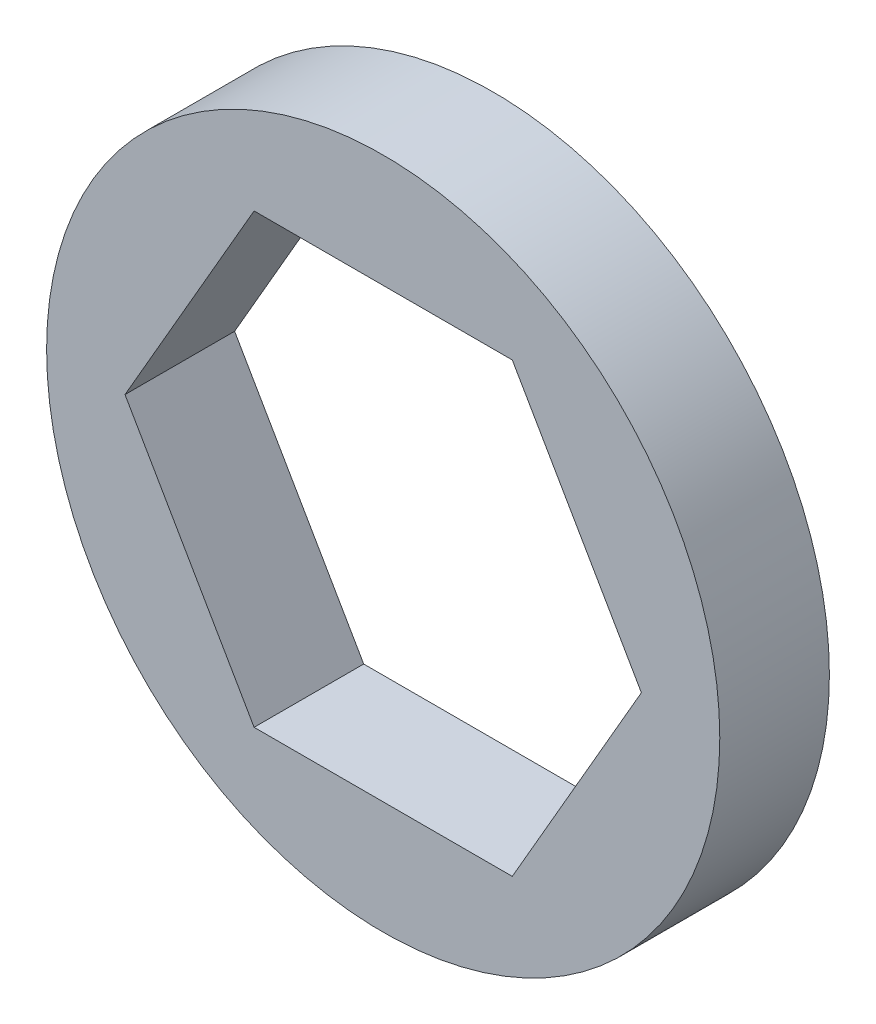
ISO-10303-21;
HEADER;
FILE_DESCRIPTION(('STEP AP214'),'2;1');
FILE_NAME('part.step','',(''),(''),'','','');
FILE_SCHEMA(('AUTOMOTIVE_DESIGN { 1 0 10303 214 1 1 1 1 }'));
ENDSEC;
DATA;
#1=APPLICATION_CONTEXT('core data for automotive mechanical design processes');
#2=APPLICATION_PROTOCOL_DEFINITION('international standard','automotive_design',2000,#1);
#3=PRODUCT_CONTEXT('',#1,'mechanical');
#4=PRODUCT('Part','Part','',(#3));
#5=PRODUCT_RELATED_PRODUCT_CATEGORY('part','',(#4));
#6=PRODUCT_DEFINITION_FORMATION('','',#4);
#7=PRODUCT_DEFINITION_CONTEXT('part definition',#1,'design');
#8=PRODUCT_DEFINITION('design','',#6,#7);
#9=PRODUCT_DEFINITION_SHAPE('','',#8);
#10=(LENGTH_UNIT() NAMED_UNIT(*) SI_UNIT(.MILLI.,.METRE.));
#11=(NAMED_UNIT(*) PLANE_ANGLE_UNIT() SI_UNIT($,.RADIAN.));
#12=(NAMED_UNIT(*) SI_UNIT($,.STERADIAN.) SOLID_ANGLE_UNIT());
#13=UNCERTAINTY_MEASURE_WITH_UNIT(LENGTH_MEASURE(1.E-05),#10,'distance_accuracy_value','');
#14=(GEOMETRIC_REPRESENTATION_CONTEXT(3) GLOBAL_UNCERTAINTY_ASSIGNED_CONTEXT((#13)) GLOBAL_UNIT_ASSIGNED_CONTEXT((#10,
#11,#12)) REPRESENTATION_CONTEXT('',''));
#15=CARTESIAN_POINT('',(0.,0.,0.));
#16=DIRECTION('',(0.,0.,1.));
#17=DIRECTION('',(1.,0.,0.));
#18=AXIS2_PLACEMENT_3D('',#15,#16,#17);
#19=CARTESIAN_POINT('',(0.,0.,0.));
#20=DIRECTION('',(0.,0.,1.));
#21=DIRECTION('',(1.,0.,0.));
#22=AXIS2_PLACEMENT_3D('',#19,#20,#21);
#23=CYLINDRICAL_SURFACE('',#22,9.75);
#24=CARTESIAN_POINT('',(0.,0.,0.));
#25=DIRECTION('',(0.,0.,1.));
#26=DIRECTION('',(-1.,0.,0.));
#27=AXIS2_PLACEMENT_3D('',#24,#25,#26);
#28=CIRCLE('',#27,9.75);
#29=CARTESIAN_POINT('',(-9.75,0.,0.));
#30=VERTEX_POINT('',#29);
#31=EDGE_CURVE('E11',#30,#30,#28,.T.);
#32=ORIENTED_EDGE('',*,*,#31,.T.);
#33=EDGE_LOOP('',(#32));
#34=FACE_BOUND('',#33,.T.);
#35=CARTESIAN_POINT('',(0.,0.,3.175));
#36=DIRECTION('',(0.,0.,1.));
#37=DIRECTION('',(-1.,0.,0.));
#38=AXIS2_PLACEMENT_3D('',#35,#36,#37);
#39=CIRCLE('',#38,9.75);
#40=CARTESIAN_POINT('',(-9.75,0.,3.175));
#41=VERTEX_POINT('',#40);
#42=EDGE_CURVE('E35',#41,#41,#39,.T.);
#43=ORIENTED_EDGE('',*,*,#42,.F.);
#44=EDGE_LOOP('',(#43));
#45=FACE_BOUND('',#44,.T.);
#46=ADVANCED_FACE('F32',(#34,#45),#23,.T.);
#47=CARTESIAN_POINT('',(0.,0.,0.));
#48=DIRECTION('',(0.,0.,-1.));
#49=DIRECTION('',(-1.,0.,0.));
#50=AXIS2_PLACEMENT_3D('',#47,#48,#49);
#51=PLANE('',#50);
#52=DIRECTION('',(-0.5,-0.866025403784439,0.));
#53=VECTOR('',#52,1.);
#54=CARTESIAN_POINT('',(-7.47899538708241,0.,0.));
#55=LINE('',#54,#53);
#56=CARTESIAN_POINT('',(-3.73949769354121,6.477,0.));
#57=VERTEX_POINT('',#56);
#58=CARTESIAN_POINT('',(-7.47899538708241,0.,0.));
#59=VERTEX_POINT('',#58);
#60=EDGE_CURVE('E86',#57,#59,#55,.T.);
#61=ORIENTED_EDGE('',*,*,#60,.T.);
#62=DIRECTION('',(0.5,-0.866025403784439,0.));
#63=VECTOR('',#62,1.);
#64=CARTESIAN_POINT('',(-3.73949769354121,-6.477,0.));
#65=LINE('',#64,#63);
#66=CARTESIAN_POINT('',(-3.73949769354121,-6.477,0.));
#67=VERTEX_POINT('',#66);
#68=EDGE_CURVE('E95',#59,#67,#65,.T.);
#69=ORIENTED_EDGE('',*,*,#68,.T.);
#70=DIRECTION('',(1.,0.,0.));
#71=VECTOR('',#70,1.);
#72=CARTESIAN_POINT('',(3.73949769354121,-6.477,0.));
#73=LINE('',#72,#71);
#74=CARTESIAN_POINT('',(3.73949769354121,-6.477,0.));
#75=VERTEX_POINT('',#74);
#76=EDGE_CURVE('E46',#67,#75,#73,.T.);
#77=ORIENTED_EDGE('',*,*,#76,.T.);
#78=DIRECTION('',(0.5,0.866025403784439,0.));
#79=VECTOR('',#78,1.);
#80=CARTESIAN_POINT('',(7.47899538708242,0.,0.));
#81=LINE('',#80,#79);
#82=CARTESIAN_POINT('',(7.47899538708242,0.,0.));
#83=VERTEX_POINT('',#82);
#84=EDGE_CURVE('E110',#75,#83,#81,.T.);
#85=ORIENTED_EDGE('',*,*,#84,.T.);
#86=DIRECTION('',(-0.5,0.866025403784438,0.));
#87=VECTOR('',#86,1.);
#88=CARTESIAN_POINT('',(3.7394976935412,6.477,0.));
#89=LINE('',#88,#87);
#90=CARTESIAN_POINT('',(3.7394976935412,6.477,0.));
#91=VERTEX_POINT('',#90);
#92=EDGE_CURVE('E113',#83,#91,#89,.T.);
#93=ORIENTED_EDGE('',*,*,#92,.T.);
#94=DIRECTION('',(-1.,0.,0.));
#95=VECTOR('',#94,1.);
#96=CARTESIAN_POINT('',(-3.73949769354121,6.477,0.));
#97=LINE('',#96,#95);
#98=EDGE_CURVE('E92',#91,#57,#97,.T.);
#99=ORIENTED_EDGE('',*,*,#98,.T.);
#100=EDGE_LOOP('',(#61,#69,#77,#85,#93,#99));
#101=FACE_BOUND('',#100,.T.);
#102=ORIENTED_EDGE('',*,*,#31,.F.);
#103=EDGE_LOOP('',(#102));
#104=FACE_BOUND('',#103,.T.);
#105=ADVANCED_FACE('F99',(#101,#104),#51,.T.);
#106=CARTESIAN_POINT('',(0.,0.,3.175));
#107=DIRECTION('',(0.,0.,-1.));
#108=DIRECTION('',(-1.,0.,0.));
#109=AXIS2_PLACEMENT_3D('',#106,#107,#108);
#110=PLANE('',#109);
#111=DIRECTION('',(0.5,-0.866025403784439,0.));
#112=VECTOR('',#111,1.);
#113=CARTESIAN_POINT('',(-3.73949769354121,-6.477,3.175));
#114=LINE('',#113,#112);
#115=CARTESIAN_POINT('',(-7.47899538708242,0.,3.175));
#116=VERTEX_POINT('',#115);
#117=CARTESIAN_POINT('',(-3.73949769354121,-6.477,3.175));
#118=VERTEX_POINT('',#117);
#119=EDGE_CURVE('E117',#116,#118,#114,.T.);
#120=ORIENTED_EDGE('',*,*,#119,.F.);
#121=DIRECTION('',(-0.5,-0.866025403784439,0.));
#122=VECTOR('',#121,1.);
#123=CARTESIAN_POINT('',(-7.47899538708241,0.,3.175));
#124=LINE('',#123,#122);
#125=CARTESIAN_POINT('',(-3.73949769354121,6.477,3.175));
#126=VERTEX_POINT('',#125);
#127=EDGE_CURVE('E54',#126,#116,#124,.T.);
#128=ORIENTED_EDGE('',*,*,#127,.F.);
#129=DIRECTION('',(-1.,0.,0.));
#130=VECTOR('',#129,1.);
#131=CARTESIAN_POINT('',(-3.73949769354121,6.477,3.175));
#132=LINE('',#131,#130);
#133=CARTESIAN_POINT('',(3.7394976935412,6.477,3.175));
#134=VERTEX_POINT('',#133);
#135=EDGE_CURVE('E103',#134,#126,#132,.T.);
#136=ORIENTED_EDGE('',*,*,#135,.F.);
#137=DIRECTION('',(-0.5,0.866025403784438,0.));
#138=VECTOR('',#137,1.);
#139=CARTESIAN_POINT('',(3.7394976935412,6.477,3.175));
#140=LINE('',#139,#138);
#141=CARTESIAN_POINT('',(7.47899538708242,0.,3.175));
#142=VERTEX_POINT('',#141);
#143=EDGE_CURVE('E106',#142,#134,#140,.T.);
#144=ORIENTED_EDGE('',*,*,#143,.F.);
#145=DIRECTION('',(0.5,0.866025403784439,0.));
#146=VECTOR('',#145,1.);
#147=CARTESIAN_POINT('',(7.47899538708242,0.,3.175));
#148=LINE('',#147,#146);
#149=CARTESIAN_POINT('',(3.73949769354121,-6.477,3.175));
#150=VERTEX_POINT('',#149);
#151=EDGE_CURVE('E122',#150,#142,#148,.T.);
#152=ORIENTED_EDGE('',*,*,#151,.F.);
#153=DIRECTION('',(1.,0.,0.));
#154=VECTOR('',#153,1.);
#155=CARTESIAN_POINT('',(3.73949769354121,-6.477,3.175));
#156=LINE('',#155,#154);
#157=EDGE_CURVE('E119',#118,#150,#156,.T.);
#158=ORIENTED_EDGE('',*,*,#157,.F.);
#159=EDGE_LOOP('',(#120,#128,#136,#144,#152,#158));
#160=FACE_BOUND('',#159,.T.);
#161=ORIENTED_EDGE('',*,*,#42,.T.);
#162=EDGE_LOOP('',(#161));
#163=FACE_BOUND('',#162,.T.);
#164=ADVANCED_FACE('F139',(#160,#163),#110,.F.);
#165=CARTESIAN_POINT('',(-7.47899538708241,0.,0.));
#166=DIRECTION('',(-0.866025403784439,0.5,0.));
#167=DIRECTION('',(-0.5,-0.866025403784439,0.));
#168=AXIS2_PLACEMENT_3D('',#165,#166,#167);
#169=PLANE('',#168);
#170=ORIENTED_EDGE('',*,*,#127,.T.);
#171=DIRECTION('',(0.,0.,1.));
#172=VECTOR('',#171,1.);
#173=CARTESIAN_POINT('',(-7.47899538708241,0.,0.));
#174=LINE('',#173,#172);
#175=EDGE_CURVE('E82',#59,#116,#174,.T.);
#176=ORIENTED_EDGE('',*,*,#175,.F.);
#177=ORIENTED_EDGE('',*,*,#60,.F.);
#178=DIRECTION('',(0.,0.,1.));
#179=VECTOR('',#178,1.);
#180=CARTESIAN_POINT('',(-3.73949769354121,6.477,0.));
#181=LINE('',#180,#179);
#182=EDGE_CURVE('E127',#57,#126,#181,.T.);
#183=ORIENTED_EDGE('',*,*,#182,.T.);
#184=EDGE_LOOP('',(#170,#176,#177,#183));
#185=FACE_BOUND('',#184,.T.);
#186=ADVANCED_FACE('F84',(#185),#169,.F.);
#187=CARTESIAN_POINT('',(-3.73949769354121,6.477,0.));
#188=DIRECTION('',(0.,1.,0.));
#189=DIRECTION('',(-1.,0.,0.));
#190=AXIS2_PLACEMENT_3D('',#187,#188,#189);
#191=PLANE('',#190);
#192=ORIENTED_EDGE('',*,*,#135,.T.);
#193=ORIENTED_EDGE('',*,*,#182,.F.);
#194=ORIENTED_EDGE('',*,*,#98,.F.);
#195=DIRECTION('',(0.,0.,1.));
#196=VECTOR('',#195,1.);
#197=CARTESIAN_POINT('',(3.7394976935412,6.477,0.));
#198=LINE('',#197,#196);
#199=EDGE_CURVE('E129',#91,#134,#198,.T.);
#200=ORIENTED_EDGE('',*,*,#199,.T.);
#201=EDGE_LOOP('',(#192,#193,#194,#200));
#202=FACE_BOUND('',#201,.T.);
#203=ADVANCED_FACE('F150',(#202),#191,.F.);
#204=CARTESIAN_POINT('',(3.7394976935412,6.477,0.));
#205=DIRECTION('',(0.866025403784438,0.5,0.));
#206=DIRECTION('',(-0.5,0.866025403784438,0.));
#207=AXIS2_PLACEMENT_3D('',#204,#205,#206);
#208=PLANE('',#207);
#209=ORIENTED_EDGE('',*,*,#143,.T.);
#210=ORIENTED_EDGE('',*,*,#199,.F.);
#211=ORIENTED_EDGE('',*,*,#92,.F.);
#212=DIRECTION('',(0.,0.,1.));
#213=VECTOR('',#212,1.);
#214=CARTESIAN_POINT('',(7.47899538708242,0.,0.));
#215=LINE('',#214,#213);
#216=EDGE_CURVE('E131',#83,#142,#215,.T.);
#217=ORIENTED_EDGE('',*,*,#216,.T.);
#218=EDGE_LOOP('',(#209,#210,#211,#217));
#219=FACE_BOUND('',#218,.T.);
#220=ADVANCED_FACE('F148',(#219),#208,.F.);
#221=CARTESIAN_POINT('',(7.47899538708242,0.,0.));
#222=DIRECTION('',(0.866025403784439,-0.5,0.));
#223=DIRECTION('',(0.5,0.866025403784439,0.));
#224=AXIS2_PLACEMENT_3D('',#221,#222,#223);
#225=PLANE('',#224);
#226=ORIENTED_EDGE('',*,*,#151,.T.);
#227=ORIENTED_EDGE('',*,*,#216,.F.);
#228=ORIENTED_EDGE('',*,*,#84,.F.);
#229=DIRECTION('',(0.,0.,1.));
#230=VECTOR('',#229,1.);
#231=CARTESIAN_POINT('',(3.73949769354121,-6.477,0.));
#232=LINE('',#231,#230);
#233=EDGE_CURVE('E133',#75,#150,#232,.T.);
#234=ORIENTED_EDGE('',*,*,#233,.T.);
#235=EDGE_LOOP('',(#226,#227,#228,#234));
#236=FACE_BOUND('',#235,.T.);
#237=ADVANCED_FACE('F144',(#236),#225,.F.);
#238=CARTESIAN_POINT('',(3.73949769354121,-6.477,0.));
#239=DIRECTION('',(0.,-1.,0.));
#240=DIRECTION('',(0.,0.,-1.));
#241=AXIS2_PLACEMENT_3D('',#238,#239,#240);
#242=PLANE('',#241);
#243=ORIENTED_EDGE('',*,*,#157,.T.);
#244=ORIENTED_EDGE('',*,*,#233,.F.);
#245=ORIENTED_EDGE('',*,*,#76,.F.);
#246=DIRECTION('',(0.,0.,1.));
#247=VECTOR('',#246,1.);
#248=CARTESIAN_POINT('',(-3.73949769354121,-6.477,0.));
#249=LINE('',#248,#247);
#250=EDGE_CURVE('E91',#67,#118,#249,.T.);
#251=ORIENTED_EDGE('',*,*,#250,.T.);
#252=EDGE_LOOP('',(#243,#244,#245,#251));
#253=FACE_BOUND('',#252,.T.);
#254=ADVANCED_FACE('F135',(#253),#242,.F.);
#255=CARTESIAN_POINT('',(-3.73949769354121,-6.477,0.));
#256=DIRECTION('',(-0.866025403784439,-0.5,0.));
#257=DIRECTION('',(0.5,-0.866025403784439,0.));
#258=AXIS2_PLACEMENT_3D('',#255,#256,#257);
#259=PLANE('',#258);
#260=ORIENTED_EDGE('',*,*,#119,.T.);
#261=ORIENTED_EDGE('',*,*,#250,.F.);
#262=ORIENTED_EDGE('',*,*,#68,.F.);
#263=ORIENTED_EDGE('',*,*,#175,.T.);
#264=EDGE_LOOP('',(#260,#261,#262,#263));
#265=FACE_BOUND('',#264,.T.);
#266=ADVANCED_FACE('F96',(#265),#259,.F.);
#267=CLOSED_SHELL('',(#46,#105,#164,#186,#203,#220,#237,#254,#266));
#268=MANIFOLD_SOLID_BREP('B2',#267);
#269=ADVANCED_BREP_SHAPE_REPRESENTATION('',(#18,#268),#14);
#270=SHAPE_DEFINITION_REPRESENTATION(#9,#269);
ENDSEC;
END-ISO-10303-21;
